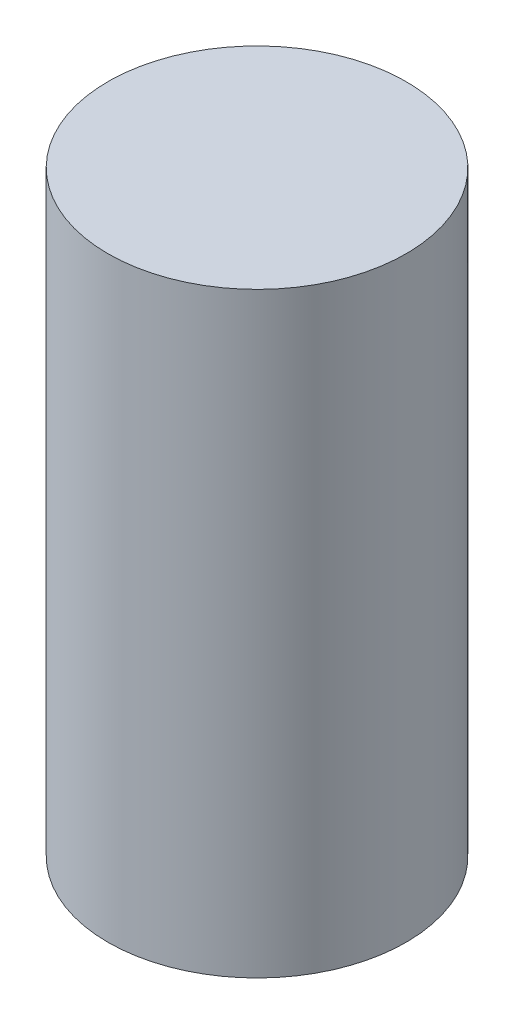
ISO-10303-21;
HEADER;
FILE_DESCRIPTION(('STEP AP214'),'2;1');
FILE_NAME('part.step','',(''),(''),'','','');
FILE_SCHEMA(('AUTOMOTIVE_DESIGN { 1 0 10303 214 1 1 1 1 }'));
ENDSEC;
DATA;
#1=APPLICATION_CONTEXT('core data for automotive mechanical design processes');
#2=APPLICATION_PROTOCOL_DEFINITION('international standard','automotive_design',2000,#1);
#3=PRODUCT_CONTEXT('',#1,'mechanical');
#4=PRODUCT('Part','Part','',(#3));
#5=PRODUCT_RELATED_PRODUCT_CATEGORY('part','',(#4));
#6=PRODUCT_DEFINITION_FORMATION('','',#4);
#7=PRODUCT_DEFINITION_CONTEXT('part definition',#1,'design');
#8=PRODUCT_DEFINITION('design','',#6,#7);
#9=PRODUCT_DEFINITION_SHAPE('','',#8);
#10=(LENGTH_UNIT() NAMED_UNIT(*) SI_UNIT(.MILLI.,.METRE.));
#11=(NAMED_UNIT(*) PLANE_ANGLE_UNIT() SI_UNIT($,.RADIAN.));
#12=(NAMED_UNIT(*) SI_UNIT($,.STERADIAN.) SOLID_ANGLE_UNIT());
#13=UNCERTAINTY_MEASURE_WITH_UNIT(LENGTH_MEASURE(1.E-05),#10,'distance_accuracy_value','');
#14=(GEOMETRIC_REPRESENTATION_CONTEXT(3) GLOBAL_UNCERTAINTY_ASSIGNED_CONTEXT((#13)) GLOBAL_UNIT_ASSIGNED_CONTEXT((#10,
#11,#12)) REPRESENTATION_CONTEXT('',''));
#15=CARTESIAN_POINT('',(0.,0.,0.));
#16=DIRECTION('',(0.,0.,1.));
#17=DIRECTION('',(1.,0.,0.));
#18=AXIS2_PLACEMENT_3D('',#15,#16,#17);
#19=CARTESIAN_POINT('',(0.,1.,0.));
#20=DIRECTION('',(0.,-1.,0.));
#21=DIRECTION('',(0.,0.,-1.));
#22=AXIS2_PLACEMENT_3D('',#19,#20,#21);
#23=CYLINDRICAL_SURFACE('',#22,0.25);
#24=CARTESIAN_POINT('',(0.,1.,0.));
#25=DIRECTION('',(0.,1.,0.));
#26=DIRECTION('',(0.,0.,1.));
#27=AXIS2_PLACEMENT_3D('',#24,#25,#26);
#28=CIRCLE('',#27,0.25);
#29=CARTESIAN_POINT('',(0.,1.,0.25));
#30=VERTEX_POINT('',#29);
#31=EDGE_CURVE('E10',#30,#30,#28,.T.);
#32=ORIENTED_EDGE('',*,*,#31,.F.);
#33=EDGE_LOOP('',(#32));
#34=FACE_BOUND('',#33,.T.);
#35=CARTESIAN_POINT('',(0.,0.,0.));
#36=DIRECTION('',(0.,1.,0.));
#37=DIRECTION('',(0.,0.,1.));
#38=AXIS2_PLACEMENT_3D('',#35,#36,#37);
#39=CIRCLE('',#38,0.25);
#40=CARTESIAN_POINT('',(0.,0.,0.25));
#41=VERTEX_POINT('',#40);
#42=EDGE_CURVE('E41',#41,#41,#39,.T.);
#43=ORIENTED_EDGE('',*,*,#42,.T.);
#44=EDGE_LOOP('',(#43));
#45=FACE_BOUND('',#44,.T.);
#46=ADVANCED_FACE('F38',(#34,#45),#23,.T.);
#47=CARTESIAN_POINT('',(0.,1.,0.));
#48=DIRECTION('',(0.,1.,0.));
#49=DIRECTION('',(0.,0.,1.));
#50=AXIS2_PLACEMENT_3D('',#47,#48,#49);
#51=PLANE('',#50);
#52=ORIENTED_EDGE('',*,*,#31,.T.);
#53=EDGE_LOOP('',(#52));
#54=FACE_BOUND('',#53,.T.);
#55=ADVANCED_FACE('F53',(#54),#51,.T.);
#56=CARTESIAN_POINT('',(0.,0.,0.));
#57=DIRECTION('',(0.,1.,0.));
#58=DIRECTION('',(0.,0.,1.));
#59=AXIS2_PLACEMENT_3D('',#56,#57,#58);
#60=PLANE('',#59);
#61=ORIENTED_EDGE('',*,*,#42,.F.);
#62=EDGE_LOOP('',(#61));
#63=FACE_BOUND('',#62,.T.);
#64=ADVANCED_FACE('F51',(#63),#60,.F.);
#65=CLOSED_SHELL('',(#46,#55,#64));
#66=MANIFOLD_SOLID_BREP('B2',#65);
#67=ADVANCED_BREP_SHAPE_REPRESENTATION('',(#18,#66),#14);
#68=SHAPE_DEFINITION_REPRESENTATION(#9,#67);
ENDSEC;
END-ISO-10303-21;
